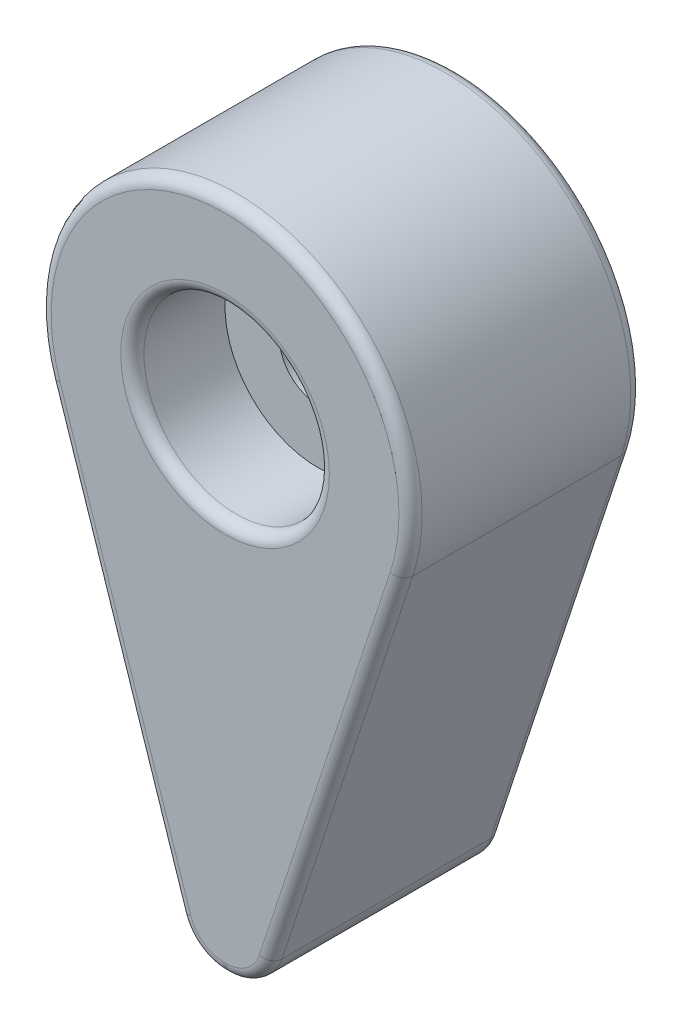
ISO-10303-21;
HEADER;
FILE_DESCRIPTION(('STEP AP214'),'2;1');
FILE_NAME('part.step','',(''),(''),'','','');
FILE_SCHEMA(('AUTOMOTIVE_DESIGN { 1 0 10303 214 1 1 1 1 }'));
ENDSEC;
DATA;
#1=APPLICATION_CONTEXT('core data for automotive mechanical design processes');
#2=APPLICATION_PROTOCOL_DEFINITION('international standard','automotive_design',2000,#1);
#3=PRODUCT_CONTEXT('',#1,'mechanical');
#4=PRODUCT('Part','Part','',(#3));
#5=PRODUCT_RELATED_PRODUCT_CATEGORY('part','',(#4));
#6=PRODUCT_DEFINITION_FORMATION('','',#4);
#7=PRODUCT_DEFINITION_CONTEXT('part definition',#1,'design');
#8=PRODUCT_DEFINITION('design','',#6,#7);
#9=PRODUCT_DEFINITION_SHAPE('','',#8);
#10=(LENGTH_UNIT() NAMED_UNIT(*) SI_UNIT(.MILLI.,.METRE.));
#11=(NAMED_UNIT(*) PLANE_ANGLE_UNIT() SI_UNIT($,.RADIAN.));
#12=(NAMED_UNIT(*) SI_UNIT($,.STERADIAN.) SOLID_ANGLE_UNIT());
#13=UNCERTAINTY_MEASURE_WITH_UNIT(LENGTH_MEASURE(1.E-05),#10,'distance_accuracy_value','');
#14=(GEOMETRIC_REPRESENTATION_CONTEXT(3) GLOBAL_UNCERTAINTY_ASSIGNED_CONTEXT((#13)) GLOBAL_UNIT_ASSIGNED_CONTEXT((#10,
#11,#12)) REPRESENTATION_CONTEXT('',''));
#15=CARTESIAN_POINT('',(0.,0.,0.));
#16=DIRECTION('',(0.,0.,1.));
#17=DIRECTION('',(1.,0.,0.));
#18=AXIS2_PLACEMENT_3D('',#15,#16,#17);
#19=CARTESIAN_POINT('',(-1.5,-21.,10.));
#20=DIRECTION('',(0.,1.,0.));
#21=DIRECTION('',(0.,0.,1.));
#22=AXIS2_PLACEMENT_3D('',#19,#20,#21);
#23=PLANE('',#22);
#24=DIRECTION('',(0.,0.,-1.));
#25=VECTOR('',#24,1.);
#26=CARTESIAN_POINT('',(-0.053493648679276,-21.,10.));
#27=LINE('',#26,#25);
#28=CARTESIAN_POINT('',(-0.053493648679276,-21.,9.5));
#29=VERTEX_POINT('',#28);
#30=CARTESIAN_POINT('',(-0.053493648679276,-21.,0.5));
#31=VERTEX_POINT('',#30);
#32=EDGE_CURVE('E246',#29,#31,#27,.T.);
#33=ORIENTED_EDGE('',*,*,#32,.T.);
#34=DIRECTION('',(1.,0.,0.));
#35=VECTOR('',#34,1.);
#36=CARTESIAN_POINT('',(-1.5,-21.,0.5));
#37=LINE('',#36,#35);
#38=CARTESIAN_POINT('',(0.0534936486792851,-21.,0.5));
#39=VERTEX_POINT('',#38);
#40=EDGE_CURVE('E217',#31,#39,#37,.T.);
#41=ORIENTED_EDGE('',*,*,#40,.T.);
#42=DIRECTION('',(0.,0.,-1.));
#43=VECTOR('',#42,1.);
#44=CARTESIAN_POINT('',(0.0534936486792851,-21.,10.));
#45=LINE('',#44,#43);
#46=CARTESIAN_POINT('',(0.0534936486792851,-21.,9.5));
#47=VERTEX_POINT('',#46);
#48=EDGE_CURVE('E243',#39,#47,#45,.F.);
#49=ORIENTED_EDGE('',*,*,#48,.T.);
#50=DIRECTION('',(1.,0.,0.));
#51=VECTOR('',#50,1.);
#52=CARTESIAN_POINT('',(-0.053493648679276,-21.,9.5));
#53=LINE('',#52,#51);
#54=EDGE_CURVE('E219',#47,#29,#53,.F.);
#55=ORIENTED_EDGE('',*,*,#54,.T.);
#56=EDGE_LOOP('',(#33,#41,#49,#55));
#57=FACE_BOUND('',#56,.T.);
#58=ADVANCED_FACE('F43',(#57),#23,.F.);
#59=CARTESIAN_POINT('',(1.5,-21.,10.));
#60=DIRECTION('',(-0.949715023073118,0.313115593590015,0.));
#61=DIRECTION('',(-0.313115593590015,-0.949715023073118,0.));
#62=AXIS2_PLACEMENT_3D('',#59,#60,#61);
#63=PLANE('',#62);
#64=DIRECTION('',(0.,0.,-1.));
#65=VECTOR('',#64,1.);
#66=CARTESIAN_POINT('',(1.95292369482552,-19.62623118718,10.));
#67=LINE('',#66,#65);
#68=CARTESIAN_POINT('',(1.95292369482552,-19.62623118718,9.5));
#69=VERTEX_POINT('',#68);
#70=CARTESIAN_POINT('',(1.95292369482552,-19.62623118718,0.5));
#71=VERTEX_POINT('',#70);
#72=EDGE_CURVE('E249',#69,#71,#67,.T.);
#73=ORIENTED_EDGE('',*,*,#72,.T.);
#74=DIRECTION('',(0.313115593590015,0.949715023073118,0.));
#75=VECTOR('',#74,1.);
#76=CARTESIAN_POINT('',(1.5,-21.,0.5));
#77=LINE('',#76,#75);
#78=CARTESIAN_POINT('',(7.59772018458495,-2.50492474872012,0.5));
#79=VERTEX_POINT('',#78);
#80=EDGE_CURVE('E209',#71,#79,#77,.T.);
#81=ORIENTED_EDGE('',*,*,#80,.T.);
#82=DIRECTION('',(0.,0.,-1.));
#83=VECTOR('',#82,1.);
#84=CARTESIAN_POINT('',(7.59772018458495,-2.50492474872012,10.));
#85=LINE('',#84,#83);
#86=CARTESIAN_POINT('',(7.59772018458495,-2.50492474872012,9.5));
#87=VERTEX_POINT('',#86);
#88=EDGE_CURVE('E156',#87,#79,#85,.T.);
#89=ORIENTED_EDGE('',*,*,#88,.F.);
#90=DIRECTION('',(0.313115593590015,0.949715023073118,0.));
#91=VECTOR('',#90,1.);
#92=CARTESIAN_POINT('',(1.95292369482552,-19.62623118718,9.5));
#93=LINE('',#92,#91);
#94=EDGE_CURVE('E211',#87,#69,#93,.F.);
#95=ORIENTED_EDGE('',*,*,#94,.T.);
#96=EDGE_LOOP('',(#73,#81,#89,#95));
#97=FACE_BOUND('',#96,.T.);
#98=ADVANCED_FACE('F278',(#97),#63,.F.);
#99=CARTESIAN_POINT('',(0.,0.,10.));
#100=DIRECTION('',(0.,0.,-1.));
#101=DIRECTION('',(-1.,0.,0.));
#102=AXIS2_PLACEMENT_3D('',#99,#100,#101);
#103=CYLINDRICAL_SURFACE('',#102,8.);
#104=ORIENTED_EDGE('',*,*,#88,.T.);
#105=CARTESIAN_POINT('',(0.,0.,0.5));
#106=DIRECTION('',(0.,0.,1.));
#107=DIRECTION('',(1.,0.,0.));
#108=AXIS2_PLACEMENT_3D('',#105,#106,#107);
#109=CIRCLE('',#108,8.);
#110=CARTESIAN_POINT('',(-7.59772018458494,-2.50492474872013,0.5));
#111=VERTEX_POINT('',#110);
#112=EDGE_CURVE('E155',#79,#111,#109,.T.);
#113=ORIENTED_EDGE('',*,*,#112,.T.);
#114=DIRECTION('',(0.,0.,-1.));
#115=VECTOR('',#114,1.);
#116=CARTESIAN_POINT('',(-7.59772018458494,-2.50492474872013,10.));
#117=LINE('',#116,#115);
#118=CARTESIAN_POINT('',(-7.59772018458494,-2.50492474872013,9.5));
#119=VERTEX_POINT('',#118);
#120=EDGE_CURVE('E138',#119,#111,#117,.T.);
#121=ORIENTED_EDGE('',*,*,#120,.F.);
#122=CARTESIAN_POINT('',(0.,0.,9.5));
#123=DIRECTION('',(0.,0.,1.));
#124=DIRECTION('',(1.,0.,0.));
#125=AXIS2_PLACEMENT_3D('',#122,#123,#124);
#126=CIRCLE('',#125,8.);
#127=EDGE_CURVE('E152',#119,#87,#126,.F.);
#128=ORIENTED_EDGE('',*,*,#127,.T.);
#129=EDGE_LOOP('',(#104,#113,#121,#128));
#130=FACE_BOUND('',#129,.T.);
#131=ADVANCED_FACE('F151',(#130),#103,.T.);
#132=CARTESIAN_POINT('',(-1.5,-21.,10.));
#133=DIRECTION('',(0.949715023073118,0.313115593590016,0.));
#134=DIRECTION('',(-0.313115593590016,0.949715023073118,0.));
#135=AXIS2_PLACEMENT_3D('',#132,#133,#134);
#136=PLANE('',#135);
#137=ORIENTED_EDGE('',*,*,#120,.T.);
#138=DIRECTION('',(0.313115593590016,-0.949715023073118,0.));
#139=VECTOR('',#138,1.);
#140=CARTESIAN_POINT('',(-1.5,-21.,0.5));
#141=LINE('',#140,#139);
#142=CARTESIAN_POINT('',(-1.95292369482551,-19.62623118718,0.5));
#143=VERTEX_POINT('',#142);
#144=EDGE_CURVE('E144',#111,#143,#141,.T.);
#145=ORIENTED_EDGE('',*,*,#144,.T.);
#146=DIRECTION('',(0.,0.,-1.));
#147=VECTOR('',#146,1.);
#148=CARTESIAN_POINT('',(-1.95292369482551,-19.62623118718,10.));
#149=LINE('',#148,#147);
#150=CARTESIAN_POINT('',(-1.95292369482551,-19.62623118718,9.5));
#151=VERTEX_POINT('',#150);
#152=EDGE_CURVE('E140',#143,#151,#149,.F.);
#153=ORIENTED_EDGE('',*,*,#152,.T.);
#154=DIRECTION('',(0.313115593590016,-0.949715023073118,0.));
#155=VECTOR('',#154,1.);
#156=CARTESIAN_POINT('',(-7.59772018458494,-2.50492474872013,9.5));
#157=LINE('',#156,#155);
#158=EDGE_CURVE('E135',#151,#119,#157,.F.);
#159=ORIENTED_EDGE('',*,*,#158,.T.);
#160=EDGE_LOOP('',(#137,#145,#153,#159));
#161=FACE_BOUND('',#160,.T.);
#162=ADVANCED_FACE('F137',(#161),#136,.F.);
#163=CARTESIAN_POINT('',(0.,0.,10.));
#164=DIRECTION('',(0.,0.,1.));
#165=DIRECTION('',(1.,0.,0.));
#166=AXIS2_PLACEMENT_3D('',#163,#164,#165);
#167=PLANE('',#166);
#168=DIRECTION('',(0.313115593590016,-0.949715023073118,0.));
#169=VECTOR('',#168,1.);
#170=CARTESIAN_POINT('',(-1.47806618328895,-19.469673390385,10.));
#171=LINE('',#170,#169);
#172=CARTESIAN_POINT('',(-7.12286267304838,-2.34836695192512,10.));
#173=VERTEX_POINT('',#172);
#174=CARTESIAN_POINT('',(-1.47806618328895,-19.469673390385,10.));
#175=VERTEX_POINT('',#174);
#176=EDGE_CURVE('E60',#173,#175,#171,.T.);
#177=ORIENTED_EDGE('',*,*,#176,.T.);
#178=CARTESIAN_POINT('',(-0.053493648679276,-19.,10.));
#179=DIRECTION('',(0.,0.,1.));
#180=DIRECTION('',(1.,0.,0.));
#181=AXIS2_PLACEMENT_3D('',#178,#179,#180);
#182=CIRCLE('',#181,1.5);
#183=CARTESIAN_POINT('',(-0.053493648679276,-20.5,10.));
#184=VERTEX_POINT('',#183);
#185=EDGE_CURVE('E52',#175,#184,#182,.T.);
#186=ORIENTED_EDGE('',*,*,#185,.T.);
#187=DIRECTION('',(1.,0.,0.));
#188=VECTOR('',#187,1.);
#189=CARTESIAN_POINT('',(0.0534936486792851,-20.5,10.));
#190=LINE('',#189,#188);
#191=CARTESIAN_POINT('',(0.0534936486792852,-20.5,10.));
#192=VERTEX_POINT('',#191);
#193=EDGE_CURVE('E201',#184,#192,#190,.T.);
#194=ORIENTED_EDGE('',*,*,#193,.T.);
#195=CARTESIAN_POINT('',(0.0534936486792852,-19.,10.));
#196=DIRECTION('',(0.,0.,1.));
#197=DIRECTION('',(1.,0.,0.));
#198=AXIS2_PLACEMENT_3D('',#195,#196,#197);
#199=CIRCLE('',#198,1.5);
#200=CARTESIAN_POINT('',(1.47806618328896,-19.469673390385,10.));
#201=VERTEX_POINT('',#200);
#202=EDGE_CURVE('E199',#192,#201,#199,.T.);
#203=ORIENTED_EDGE('',*,*,#202,.T.);
#204=DIRECTION('',(0.313115593590015,0.949715023073118,0.));
#205=VECTOR('',#204,1.);
#206=CARTESIAN_POINT('',(7.12286267304839,-2.34836695192511,10.));
#207=LINE('',#206,#205);
#208=CARTESIAN_POINT('',(7.12286267304839,-2.34836695192511,10.));
#209=VERTEX_POINT('',#208);
#210=EDGE_CURVE('E197',#201,#209,#207,.T.);
#211=ORIENTED_EDGE('',*,*,#210,.T.);
#212=CARTESIAN_POINT('',(0.,0.,10.));
#213=DIRECTION('',(0.,0.,1.));
#214=DIRECTION('',(1.,0.,0.));
#215=AXIS2_PLACEMENT_3D('',#212,#213,#214);
#216=CIRCLE('',#215,7.5);
#217=EDGE_CURVE('E65',#209,#173,#216,.T.);
#218=ORIENTED_EDGE('',*,*,#217,.T.);
#219=EDGE_LOOP('',(#177,#186,#194,#203,#211,#218));
#220=FACE_BOUND('',#219,.T.);
#221=CARTESIAN_POINT('',(0.,0.,10.));
#222=DIRECTION('',(0.,0.,1.));
#223=DIRECTION('',(1.,0.,0.));
#224=AXIS2_PLACEMENT_3D('',#221,#222,#223);
#225=CIRCLE('',#224,4.5);
#226=CARTESIAN_POINT('',(4.5,0.,10.));
#227=VERTEX_POINT('',#226);
#228=EDGE_CURVE('E203',#227,#227,#225,.F.);
#229=ORIENTED_EDGE('',*,*,#228,.T.);
#230=EDGE_LOOP('',(#229));
#231=FACE_BOUND('',#230,.T.);
#232=ADVANCED_FACE('F373',(#220,#231),#167,.T.);
#233=CARTESIAN_POINT('',(0.,0.,0.));
#234=DIRECTION('',(0.,0.,1.));
#235=DIRECTION('',(1.,0.,0.));
#236=AXIS2_PLACEMENT_3D('',#233,#234,#235);
#237=PLANE('',#236);
#238=DIRECTION('',(0.313115593590016,-0.949715023073118,0.));
#239=VECTOR('',#238,1.);
#240=CARTESIAN_POINT('',(-7.12286267304838,-2.34836695192512,0.));
#241=LINE('',#240,#239);
#242=CARTESIAN_POINT('',(-1.47806618328895,-19.469673390385,0.));
#243=VERTEX_POINT('',#242);
#244=CARTESIAN_POINT('',(-7.12286267304838,-2.34836695192512,0.));
#245=VERTEX_POINT('',#244);
#246=EDGE_CURVE('E228',#243,#245,#241,.F.);
#247=ORIENTED_EDGE('',*,*,#246,.T.);
#248=CARTESIAN_POINT('',(0.,0.,0.));
#249=DIRECTION('',(0.,0.,1.));
#250=DIRECTION('',(1.,0.,0.));
#251=AXIS2_PLACEMENT_3D('',#248,#249,#250);
#252=CIRCLE('',#251,7.5);
#253=CARTESIAN_POINT('',(7.12286267304839,-2.34836695192512,0.));
#254=VERTEX_POINT('',#253);
#255=EDGE_CURVE('E145',#245,#254,#252,.F.);
#256=ORIENTED_EDGE('',*,*,#255,.T.);
#257=DIRECTION('',(0.313115593590015,0.949715023073118,0.));
#258=VECTOR('',#257,1.);
#259=CARTESIAN_POINT('',(7.12286267304839,-2.34836695192512,0.));
#260=LINE('',#259,#258);
#261=CARTESIAN_POINT('',(1.47806618328896,-19.469673390385,0.));
#262=VERTEX_POINT('',#261);
#263=EDGE_CURVE('E236',#254,#262,#260,.F.);
#264=ORIENTED_EDGE('',*,*,#263,.T.);
#265=CARTESIAN_POINT('',(0.0534936486792852,-19.,0.));
#266=DIRECTION('',(0.,0.,1.));
#267=DIRECTION('',(1.,0.,0.));
#268=AXIS2_PLACEMENT_3D('',#265,#266,#267);
#269=CIRCLE('',#268,1.5);
#270=CARTESIAN_POINT('',(0.0534936486792851,-20.5,0.));
#271=VERTEX_POINT('',#270);
#272=EDGE_CURVE('E234',#262,#271,#269,.F.);
#273=ORIENTED_EDGE('',*,*,#272,.T.);
#274=DIRECTION('',(1.,0.,0.));
#275=VECTOR('',#274,1.);
#276=CARTESIAN_POINT('',(0.,-20.5,0.));
#277=LINE('',#276,#275);
#278=CARTESIAN_POINT('',(-0.053493648679276,-20.5,0.));
#279=VERTEX_POINT('',#278);
#280=EDGE_CURVE('E232',#271,#279,#277,.F.);
#281=ORIENTED_EDGE('',*,*,#280,.T.);
#282=CARTESIAN_POINT('',(-0.053493648679276,-19.,0.));
#283=DIRECTION('',(0.,0.,1.));
#284=DIRECTION('',(1.,0.,0.));
#285=AXIS2_PLACEMENT_3D('',#282,#283,#284);
#286=CIRCLE('',#285,1.5);
#287=EDGE_CURVE('E230',#279,#243,#286,.F.);
#288=ORIENTED_EDGE('',*,*,#287,.T.);
#289=EDGE_LOOP('',(#247,#256,#264,#273,#281,#288));
#290=FACE_BOUND('',#289,.T.);
#291=CARTESIAN_POINT('',(0.,0.,0.));
#292=DIRECTION('',(0.,0.,1.));
#293=DIRECTION('',(1.,0.,0.));
#294=AXIS2_PLACEMENT_3D('',#291,#292,#293);
#295=CIRCLE('',#294,2.14999999999999);
#296=CARTESIAN_POINT('',(2.14999999999999,0.,0.));
#297=VERTEX_POINT('',#296);
#298=EDGE_CURVE('E238',#297,#297,#295,.T.);
#299=ORIENTED_EDGE('',*,*,#298,.T.);
#300=EDGE_LOOP('',(#299));
#301=FACE_BOUND('',#300,.T.);
#302=ADVANCED_FACE('F289',(#290,#301),#237,.F.);
#303=CARTESIAN_POINT('',(0.0534936486792852,-19.,10.));
#304=DIRECTION('',(0.,0.,-1.));
#305=DIRECTION('',(-1.,0.,0.));
#306=AXIS2_PLACEMENT_3D('',#303,#304,#305);
#307=CYLINDRICAL_SURFACE('',#306,2.);
#308=ORIENTED_EDGE('',*,*,#48,.F.);
#309=CARTESIAN_POINT('',(0.0534936486792852,-19.,0.5));
#310=DIRECTION('',(0.,0.,1.));
#311=DIRECTION('',(1.,0.,0.));
#312=AXIS2_PLACEMENT_3D('',#309,#310,#311);
#313=CIRCLE('',#312,2.);
#314=EDGE_CURVE('E213',#39,#71,#313,.T.);
#315=ORIENTED_EDGE('',*,*,#314,.T.);
#316=ORIENTED_EDGE('',*,*,#72,.F.);
#317=CARTESIAN_POINT('',(0.0534936486792852,-19.,9.5));
#318=DIRECTION('',(0.,0.,1.));
#319=DIRECTION('',(1.,0.,0.));
#320=AXIS2_PLACEMENT_3D('',#317,#318,#319);
#321=CIRCLE('',#320,2.);
#322=EDGE_CURVE('E215',#69,#47,#321,.F.);
#323=ORIENTED_EDGE('',*,*,#322,.T.);
#324=EDGE_LOOP('',(#308,#315,#316,#323));
#325=FACE_BOUND('',#324,.T.);
#326=ADVANCED_FACE('F273',(#325),#307,.T.);
#327=CARTESIAN_POINT('',(-0.053493648679276,-19.,10.));
#328=DIRECTION('',(0.,0.,-1.));
#329=DIRECTION('',(-1.,0.,0.));
#330=AXIS2_PLACEMENT_3D('',#327,#328,#329);
#331=CYLINDRICAL_SURFACE('',#330,2.);
#332=ORIENTED_EDGE('',*,*,#152,.F.);
#333=CARTESIAN_POINT('',(-0.053493648679276,-19.,0.5));
#334=DIRECTION('',(0.,0.,1.));
#335=DIRECTION('',(1.,0.,0.));
#336=AXIS2_PLACEMENT_3D('',#333,#334,#335);
#337=CIRCLE('',#336,2.);
#338=EDGE_CURVE('E221',#143,#31,#337,.T.);
#339=ORIENTED_EDGE('',*,*,#338,.T.);
#340=ORIENTED_EDGE('',*,*,#32,.F.);
#341=CARTESIAN_POINT('',(-0.053493648679276,-19.,9.5));
#342=DIRECTION('',(0.,0.,1.));
#343=DIRECTION('',(1.,0.,0.));
#344=AXIS2_PLACEMENT_3D('',#341,#342,#343);
#345=CIRCLE('',#344,2.);
#346=EDGE_CURVE('E223',#29,#151,#345,.F.);
#347=ORIENTED_EDGE('',*,*,#346,.T.);
#348=EDGE_LOOP('',(#332,#339,#340,#347));
#349=FACE_BOUND('',#348,.T.);
#350=ADVANCED_FACE('F268',(#349),#331,.T.);
#351=CARTESIAN_POINT('',(0.,0.,6.));
#352=DIRECTION('',(0.,0.,1.));
#353=DIRECTION('',(1.,0.,0.));
#354=AXIS2_PLACEMENT_3D('',#351,#352,#353);
#355=CYLINDRICAL_SURFACE('',#354,4.);
#356=CARTESIAN_POINT('',(0.,0.,9.5));
#357=DIRECTION('',(0.,0.,1.));
#358=DIRECTION('',(1.,0.,0.));
#359=AXIS2_PLACEMENT_3D('',#356,#357,#358);
#360=CIRCLE('',#359,4.);
#361=CARTESIAN_POINT('',(4.,0.,9.5));
#362=VERTEX_POINT('',#361);
#363=EDGE_CURVE('E11',#362,#362,#360,.T.);
#364=ORIENTED_EDGE('',*,*,#363,.T.);
#365=EDGE_LOOP('',(#364));
#366=FACE_BOUND('',#365,.T.);
#367=CARTESIAN_POINT('',(0.,0.,6.));
#368=DIRECTION('',(0.,0.,1.));
#369=DIRECTION('',(1.,0.,0.));
#370=AXIS2_PLACEMENT_3D('',#367,#368,#369);
#371=CIRCLE('',#370,4.);
#372=CARTESIAN_POINT('',(4.,0.,6.));
#373=VERTEX_POINT('',#372);
#374=EDGE_CURVE('E157',#373,#373,#371,.T.);
#375=ORIENTED_EDGE('',*,*,#374,.F.);
#376=EDGE_LOOP('',(#375));
#377=FACE_BOUND('',#376,.T.);
#378=ADVANCED_FACE('F263',(#366,#377),#355,.F.);
#379=CARTESIAN_POINT('',(0.,0.,6.));
#380=DIRECTION('',(0.,0.,1.));
#381=DIRECTION('',(1.,0.,0.));
#382=AXIS2_PLACEMENT_3D('',#379,#380,#381);
#383=PLANE('',#382);
#384=CARTESIAN_POINT('',(0.,0.,6.));
#385=DIRECTION('',(0.,0.,1.));
#386=DIRECTION('',(1.,0.,0.));
#387=AXIS2_PLACEMENT_3D('',#384,#385,#386);
#388=CIRCLE('',#387,1.64999999999999);
#389=CARTESIAN_POINT('',(1.64999999999999,0.,6.));
#390=VERTEX_POINT('',#389);
#391=EDGE_CURVE('E180',#390,#390,#388,.T.);
#392=ORIENTED_EDGE('',*,*,#391,.F.);
#393=EDGE_LOOP('',(#392));
#394=FACE_BOUND('',#393,.T.);
#395=ORIENTED_EDGE('',*,*,#374,.T.);
#396=EDGE_LOOP('',(#395));
#397=FACE_BOUND('',#396,.T.);
#398=ADVANCED_FACE('F260',(#394,#397),#383,.T.);
#399=CARTESIAN_POINT('',(0.,0.,6.));
#400=DIRECTION('',(0.,0.,1.));
#401=DIRECTION('',(1.,0.,0.));
#402=AXIS2_PLACEMENT_3D('',#399,#400,#401);
#403=CYLINDRICAL_SURFACE('',#402,1.64999999999999);
#404=CARTESIAN_POINT('',(0.,0.,0.5));
#405=DIRECTION('',(0.,0.,1.));
#406=DIRECTION('',(1.,0.,0.));
#407=AXIS2_PLACEMENT_3D('',#404,#405,#406);
#408=CIRCLE('',#407,1.64999999999999);
#409=CARTESIAN_POINT('',(1.64999999999999,0.,0.5));
#410=VERTEX_POINT('',#409);
#411=EDGE_CURVE('E206',#410,#410,#408,.F.);
#412=ORIENTED_EDGE('',*,*,#411,.T.);
#413=EDGE_LOOP('',(#412));
#414=FACE_BOUND('',#413,.T.);
#415=ORIENTED_EDGE('',*,*,#391,.T.);
#416=EDGE_LOOP('',(#415));
#417=FACE_BOUND('',#416,.T.);
#418=ADVANCED_FACE('F258',(#414,#417),#403,.F.);
#419=CARTESIAN_POINT('',(-1.5,-20.5,0.5));
#420=DIRECTION('',(1.,0.,0.));
#421=DIRECTION('',(0.,0.,-1.));
#422=AXIS2_PLACEMENT_3D('',#419,#420,#421);
#423=CYLINDRICAL_SURFACE('',#422,0.5);
#424=CARTESIAN_POINT('',(-0.053493648679276,-20.5,0.5));
#425=DIRECTION('',(-1.,0.,0.));
#426=DIRECTION('',(0.,0.,1.));
#427=AXIS2_PLACEMENT_3D('',#424,#425,#426);
#428=CIRCLE('',#427,0.5);
#429=EDGE_CURVE('E181',#279,#31,#428,.T.);
#430=ORIENTED_EDGE('',*,*,#429,.F.);
#431=ORIENTED_EDGE('',*,*,#280,.F.);
#432=CARTESIAN_POINT('',(0.0534936486792851,-20.5,0.5));
#433=DIRECTION('',(1.,0.,0.));
#434=DIRECTION('',(0.,0.,-1.));
#435=AXIS2_PLACEMENT_3D('',#432,#433,#434);
#436=CIRCLE('',#435,0.5);
#437=EDGE_CURVE('E177',#39,#271,#436,.T.);
#438=ORIENTED_EDGE('',*,*,#437,.F.);
#439=ORIENTED_EDGE('',*,*,#40,.F.);
#440=EDGE_LOOP('',(#430,#431,#438,#439));
#441=FACE_BOUND('',#440,.T.);
#442=ADVANCED_FACE('F312',(#441),#423,.T.);
#443=CARTESIAN_POINT('',(0.0534936486792852,-19.,0.5));
#444=DIRECTION('',(0.,0.,1.));
#445=DIRECTION('',(1.,0.,0.));
#446=AXIS2_PLACEMENT_3D('',#443,#444,#445);
#447=TOROIDAL_SURFACE('',#446,1.5,0.5);
#448=ORIENTED_EDGE('',*,*,#437,.T.);
#449=ORIENTED_EDGE('',*,*,#272,.F.);
#450=CARTESIAN_POINT('',(1.47806618328896,-19.469673390385,0.5));
#451=DIRECTION('',(0.313115593590013,0.949715023073118,0.));
#452=DIRECTION('',(-0.949715023073118,0.313115593590013,0.));
#453=AXIS2_PLACEMENT_3D('',#450,#451,#452);
#454=CIRCLE('',#453,0.5);
#455=EDGE_CURVE('E184',#71,#262,#454,.T.);
#456=ORIENTED_EDGE('',*,*,#455,.F.);
#457=ORIENTED_EDGE('',*,*,#314,.F.);
#458=EDGE_LOOP('',(#448,#449,#456,#457));
#459=FACE_BOUND('',#458,.T.);
#460=ADVANCED_FACE('F308',(#459),#447,.T.);
#461=CARTESIAN_POINT('',(-0.053493648679276,-19.,0.5));
#462=DIRECTION('',(0.,0.,1.));
#463=DIRECTION('',(1.,0.,0.));
#464=AXIS2_PLACEMENT_3D('',#461,#462,#463);
#465=TOROIDAL_SURFACE('',#464,1.5,0.5);
#466=ORIENTED_EDGE('',*,*,#429,.T.);
#467=ORIENTED_EDGE('',*,*,#338,.F.);
#468=CARTESIAN_POINT('',(-1.47806618328895,-19.469673390385,0.5));
#469=DIRECTION('',(-0.313115593590013,0.949715023073118,0.));
#470=DIRECTION('',(-0.949715023073119,-0.313115593590013,0.));
#471=AXIS2_PLACEMENT_3D('',#468,#469,#470);
#472=CIRCLE('',#471,0.5);
#473=EDGE_CURVE('E187',#243,#143,#472,.T.);
#474=ORIENTED_EDGE('',*,*,#473,.F.);
#475=ORIENTED_EDGE('',*,*,#287,.F.);
#476=EDGE_LOOP('',(#466,#467,#474,#475));
#477=FACE_BOUND('',#476,.T.);
#478=ADVANCED_FACE('F304',(#477),#465,.T.);
#479=CARTESIAN_POINT('',(1.02514248846345,-20.843442203205,0.5));
#480=DIRECTION('',(0.313115593590015,0.949715023073118,0.));
#481=DIRECTION('',(-0.949715023073118,0.313115593590015,0.));
#482=AXIS2_PLACEMENT_3D('',#479,#480,#481);
#483=CYLINDRICAL_SURFACE('',#482,0.5);
#484=ORIENTED_EDGE('',*,*,#455,.T.);
#485=ORIENTED_EDGE('',*,*,#263,.F.);
#486=CARTESIAN_POINT('',(7.12286267304838,-2.34836695192511,0.5));
#487=DIRECTION('',(0.313115593590015,0.949715023073118,0.));
#488=DIRECTION('',(-0.949715023073118,0.313115593590015,0.));
#489=AXIS2_PLACEMENT_3D('',#486,#487,#488);
#490=CIRCLE('',#489,0.5);
#491=EDGE_CURVE('E190',#79,#254,#490,.T.);
#492=ORIENTED_EDGE('',*,*,#491,.F.);
#493=ORIENTED_EDGE('',*,*,#80,.F.);
#494=EDGE_LOOP('',(#484,#485,#492,#493));
#495=FACE_BOUND('',#494,.T.);
#496=ADVANCED_FACE('F300',(#495),#483,.T.);
#497=CARTESIAN_POINT('',(-1.02514248846344,-20.843442203205,0.5));
#498=DIRECTION('',(0.313115593590016,-0.949715023073118,0.));
#499=DIRECTION('',(0.949715023073118,0.313115593590016,0.));
#500=AXIS2_PLACEMENT_3D('',#497,#498,#499);
#501=CYLINDRICAL_SURFACE('',#500,0.5);
#502=ORIENTED_EDGE('',*,*,#473,.T.);
#503=ORIENTED_EDGE('',*,*,#144,.F.);
#504=CARTESIAN_POINT('',(-7.12286267304838,-2.34836695192512,0.5));
#505=DIRECTION('',(-0.313115593590016,0.949715023073118,0.));
#506=DIRECTION('',(-0.949715023073118,-0.313115593590016,0.));
#507=AXIS2_PLACEMENT_3D('',#504,#505,#506);
#508=CIRCLE('',#507,0.5);
#509=EDGE_CURVE('E192',#245,#111,#508,.T.);
#510=ORIENTED_EDGE('',*,*,#509,.F.);
#511=ORIENTED_EDGE('',*,*,#246,.F.);
#512=EDGE_LOOP('',(#502,#503,#510,#511));
#513=FACE_BOUND('',#512,.T.);
#514=ADVANCED_FACE('F296',(#513),#501,.T.);
#515=CARTESIAN_POINT('',(0.,0.,0.5));
#516=DIRECTION('',(0.,0.,1.));
#517=DIRECTION('',(1.,0.,0.));
#518=AXIS2_PLACEMENT_3D('',#515,#516,#517);
#519=TOROIDAL_SURFACE('',#518,7.5,0.5);
#520=ORIENTED_EDGE('',*,*,#491,.T.);
#521=ORIENTED_EDGE('',*,*,#255,.F.);
#522=ORIENTED_EDGE('',*,*,#509,.T.);
#523=ORIENTED_EDGE('',*,*,#112,.F.);
#524=EDGE_LOOP('',(#520,#521,#522,#523));
#525=FACE_BOUND('',#524,.T.);
#526=ADVANCED_FACE('F292',(#525),#519,.T.);
#527=CARTESIAN_POINT('',(0.,0.,0.5));
#528=DIRECTION('',(0.,0.,1.));
#529=DIRECTION('',(1.,0.,0.));
#530=AXIS2_PLACEMENT_3D('',#527,#528,#529);
#531=TOROIDAL_SURFACE('',#530,2.14999999999999,0.5);
#532=ORIENTED_EDGE('',*,*,#411,.F.);
#533=EDGE_LOOP('',(#532));
#534=FACE_BOUND('',#533,.T.);
#535=ORIENTED_EDGE('',*,*,#298,.F.);
#536=EDGE_LOOP('',(#535));
#537=FACE_BOUND('',#536,.T.);
#538=ADVANCED_FACE('F295',(#534,#537),#531,.T.);
#539=CARTESIAN_POINT('',(7.12286267304839,-2.34836695192512,9.5));
#540=DIRECTION('',(-0.313115593590015,-0.949715023073118,0.));
#541=DIRECTION('',(0.949715023073118,-0.313115593590015,0.));
#542=AXIS2_PLACEMENT_3D('',#539,#540,#541);
#543=CYLINDRICAL_SURFACE('',#542,0.5);
#544=CARTESIAN_POINT('',(1.47806618328896,-19.469673390385,9.5));
#545=DIRECTION('',(-0.313115593590013,-0.949715023073118,0.));
#546=DIRECTION('',(0.949715023073118,-0.313115593590013,0.));
#547=AXIS2_PLACEMENT_3D('',#544,#545,#546);
#548=CIRCLE('',#547,0.5);
#549=EDGE_CURVE('E166',#69,#201,#548,.T.);
#550=ORIENTED_EDGE('',*,*,#549,.F.);
#551=ORIENTED_EDGE('',*,*,#94,.F.);
#552=CARTESIAN_POINT('',(7.12286267304839,-2.34836695192511,9.5));
#553=DIRECTION('',(0.313115593590015,0.949715023073118,0.));
#554=DIRECTION('',(-0.949715023073118,0.313115593590016,0.));
#555=AXIS2_PLACEMENT_3D('',#552,#553,#554);
#556=CIRCLE('',#555,0.5);
#557=EDGE_CURVE('E47',#209,#87,#556,.T.);
#558=ORIENTED_EDGE('',*,*,#557,.F.);
#559=ORIENTED_EDGE('',*,*,#210,.F.);
#560=EDGE_LOOP('',(#550,#551,#558,#559));
#561=FACE_BOUND('',#560,.T.);
#562=ADVANCED_FACE('F319',(#561),#543,.T.);
#563=CARTESIAN_POINT('',(0.,0.,9.5));
#564=DIRECTION('',(0.,0.,1.));
#565=DIRECTION('',(1.,0.,0.));
#566=AXIS2_PLACEMENT_3D('',#563,#564,#565);
#567=TOROIDAL_SURFACE('',#566,7.5,0.5);
#568=ORIENTED_EDGE('',*,*,#557,.T.);
#569=ORIENTED_EDGE('',*,*,#127,.F.);
#570=CARTESIAN_POINT('',(-7.12286267304838,-2.34836695192512,9.5));
#571=DIRECTION('',(0.313115593590016,-0.949715023073118,0.));
#572=DIRECTION('',(0.949715023073118,0.313115593590016,0.));
#573=AXIS2_PLACEMENT_3D('',#570,#571,#572);
#574=CIRCLE('',#573,0.5);
#575=EDGE_CURVE('E162',#173,#119,#574,.T.);
#576=ORIENTED_EDGE('',*,*,#575,.F.);
#577=ORIENTED_EDGE('',*,*,#217,.F.);
#578=EDGE_LOOP('',(#568,#569,#576,#577));
#579=FACE_BOUND('',#578,.T.);
#580=ADVANCED_FACE('F161',(#579),#567,.T.);
#581=CARTESIAN_POINT('',(0.0534936486792852,-19.,9.5));
#582=DIRECTION('',(0.,0.,1.));
#583=DIRECTION('',(1.,0.,0.));
#584=AXIS2_PLACEMENT_3D('',#581,#582,#583);
#585=TOROIDAL_SURFACE('',#584,1.5,0.5);
#586=ORIENTED_EDGE('',*,*,#549,.T.);
#587=ORIENTED_EDGE('',*,*,#202,.F.);
#588=CARTESIAN_POINT('',(0.0534936486792852,-20.5,9.5));
#589=DIRECTION('',(-1.,0.,0.));
#590=DIRECTION('',(0.,-1.,0.));
#591=AXIS2_PLACEMENT_3D('',#588,#589,#590);
#592=CIRCLE('',#591,0.5);
#593=EDGE_CURVE('E167',#47,#192,#592,.T.);
#594=ORIENTED_EDGE('',*,*,#593,.F.);
#595=ORIENTED_EDGE('',*,*,#322,.F.);
#596=EDGE_LOOP('',(#586,#587,#594,#595));
#597=FACE_BOUND('',#596,.T.);
#598=ADVANCED_FACE('F331',(#597),#585,.T.);
#599=CARTESIAN_POINT('',(-7.12286267304838,-2.34836695192512,9.5));
#600=DIRECTION('',(-0.313115593590016,0.949715023073118,0.));
#601=DIRECTION('',(-0.949715023073118,-0.313115593590016,0.));
#602=AXIS2_PLACEMENT_3D('',#599,#600,#601);
#603=CYLINDRICAL_SURFACE('',#602,0.5);
#604=ORIENTED_EDGE('',*,*,#575,.T.);
#605=ORIENTED_EDGE('',*,*,#158,.F.);
#606=CARTESIAN_POINT('',(-1.47806618328895,-19.469673390385,9.5));
#607=DIRECTION('',(0.313115593590014,-0.949715023073118,0.));
#608=DIRECTION('',(0.949715023073118,0.313115593590014,0.));
#609=AXIS2_PLACEMENT_3D('',#606,#607,#608);
#610=CIRCLE('',#609,0.5);
#611=EDGE_CURVE('E171',#175,#151,#610,.T.);
#612=ORIENTED_EDGE('',*,*,#611,.F.);
#613=ORIENTED_EDGE('',*,*,#176,.F.);
#614=EDGE_LOOP('',(#604,#605,#612,#613));
#615=FACE_BOUND('',#614,.T.);
#616=ADVANCED_FACE('F165',(#615),#603,.T.);
#617=CARTESIAN_POINT('',(0.,-20.5,9.5));
#618=DIRECTION('',(-1.,0.,0.));
#619=DIRECTION('',(0.,0.,1.));
#620=AXIS2_PLACEMENT_3D('',#617,#618,#619);
#621=CYLINDRICAL_SURFACE('',#620,0.5);
#622=ORIENTED_EDGE('',*,*,#593,.T.);
#623=ORIENTED_EDGE('',*,*,#193,.F.);
#624=CARTESIAN_POINT('',(-0.053493648679276,-20.5,9.5));
#625=DIRECTION('',(-1.,0.,0.));
#626=DIRECTION('',(0.,0.,1.));
#627=AXIS2_PLACEMENT_3D('',#624,#625,#626);
#628=CIRCLE('',#627,0.5);
#629=EDGE_CURVE('E175',#29,#184,#628,.T.);
#630=ORIENTED_EDGE('',*,*,#629,.F.);
#631=ORIENTED_EDGE('',*,*,#54,.F.);
#632=EDGE_LOOP('',(#622,#623,#630,#631));
#633=FACE_BOUND('',#632,.T.);
#634=ADVANCED_FACE('F324',(#633),#621,.T.);
#635=CARTESIAN_POINT('',(-0.053493648679276,-19.,9.5));
#636=DIRECTION('',(0.,0.,1.));
#637=DIRECTION('',(1.,0.,0.));
#638=AXIS2_PLACEMENT_3D('',#635,#636,#637);
#639=TOROIDAL_SURFACE('',#638,1.5,0.5);
#640=ORIENTED_EDGE('',*,*,#611,.T.);
#641=ORIENTED_EDGE('',*,*,#346,.F.);
#642=ORIENTED_EDGE('',*,*,#629,.T.);
#643=ORIENTED_EDGE('',*,*,#185,.F.);
#644=EDGE_LOOP('',(#640,#641,#642,#643));
#645=FACE_BOUND('',#644,.T.);
#646=ADVANCED_FACE('F321',(#645),#639,.T.);
#647=CARTESIAN_POINT('',(0.,0.,9.5));
#648=DIRECTION('',(0.,0.,1.));
#649=DIRECTION('',(1.,0.,0.));
#650=AXIS2_PLACEMENT_3D('',#647,#648,#649);
#651=TOROIDAL_SURFACE('',#650,4.5,0.5);
#652=ORIENTED_EDGE('',*,*,#228,.F.);
#653=EDGE_LOOP('',(#652));
#654=FACE_BOUND('',#653,.T.);
#655=ORIENTED_EDGE('',*,*,#363,.F.);
#656=EDGE_LOOP('',(#655));
#657=FACE_BOUND('',#656,.T.);
#658=ADVANCED_FACE('F45',(#654,#657),#651,.T.);
#659=CLOSED_SHELL('',(#58,#98,#131,#162,#232,#302,#326,#350,#378,#398,#418,#442,#460,#478,#496,
#514,#526,#538,#562,#580,#598,#616,#634,#646,#658));
#660=MANIFOLD_SOLID_BREP('B2',#659);
#661=ADVANCED_BREP_SHAPE_REPRESENTATION('',(#18,#660),#14);
#662=SHAPE_DEFINITION_REPRESENTATION(#9,#661);
ENDSEC;
END-ISO-10303-21;
